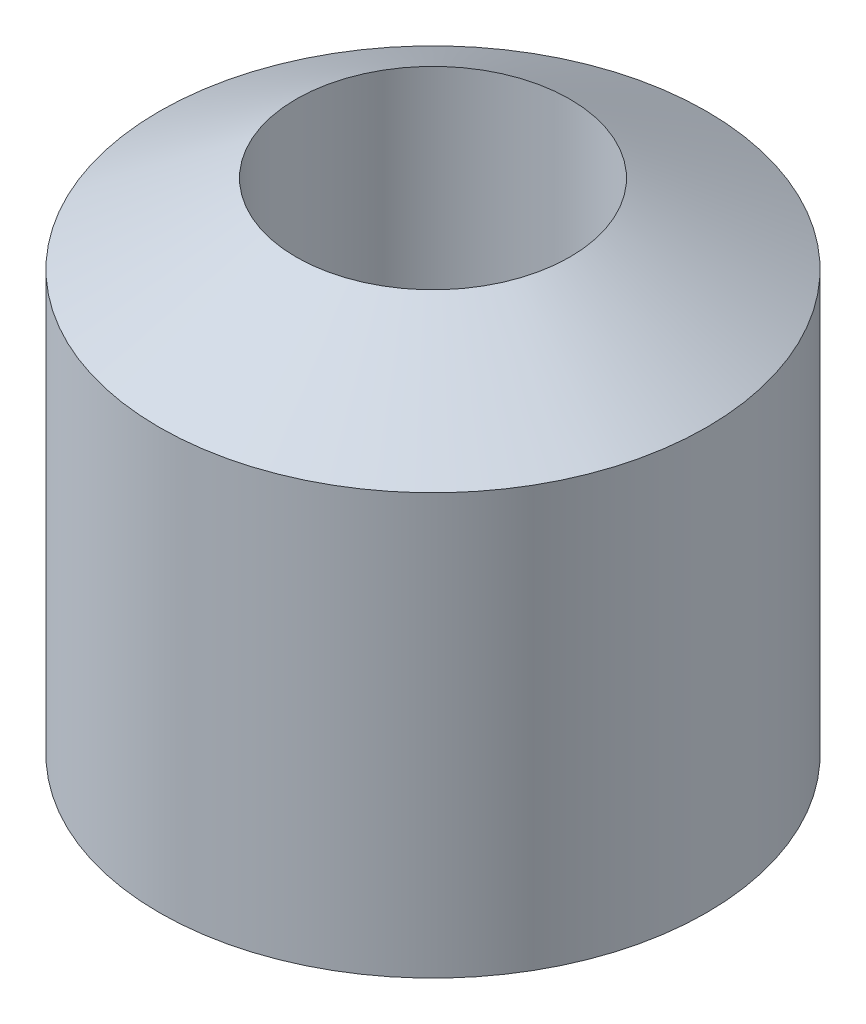
ISO-10303-21;
HEADER;
FILE_DESCRIPTION(('STEP AP214'),'2;1');
FILE_NAME('part.step','',(''),(''),'','','');
FILE_SCHEMA(('AUTOMOTIVE_DESIGN { 1 0 10303 214 1 1 1 1 }'));
ENDSEC;
DATA;
#1=APPLICATION_CONTEXT('core data for automotive mechanical design processes');
#2=APPLICATION_PROTOCOL_DEFINITION('international standard','automotive_design',2000,#1);
#3=PRODUCT_CONTEXT('',#1,'mechanical');
#4=PRODUCT('Part','Part','',(#3));
#5=PRODUCT_RELATED_PRODUCT_CATEGORY('part','',(#4));
#6=PRODUCT_DEFINITION_FORMATION('','',#4);
#7=PRODUCT_DEFINITION_CONTEXT('part definition',#1,'design');
#8=PRODUCT_DEFINITION('design','',#6,#7);
#9=PRODUCT_DEFINITION_SHAPE('','',#8);
#10=(LENGTH_UNIT() NAMED_UNIT(*) SI_UNIT(.MILLI.,.METRE.));
#11=(NAMED_UNIT(*) PLANE_ANGLE_UNIT() SI_UNIT($,.RADIAN.));
#12=(NAMED_UNIT(*) SI_UNIT($,.STERADIAN.) SOLID_ANGLE_UNIT());
#13=UNCERTAINTY_MEASURE_WITH_UNIT(LENGTH_MEASURE(1.E-05),#10,'distance_accuracy_value','');
#14=(GEOMETRIC_REPRESENTATION_CONTEXT(3) GLOBAL_UNCERTAINTY_ASSIGNED_CONTEXT((#13)) GLOBAL_UNIT_ASSIGNED_CONTEXT((#10,
#11,#12)) REPRESENTATION_CONTEXT('',''));
#15=CARTESIAN_POINT('',(0.,0.,0.));
#16=DIRECTION('',(0.,0.,1.));
#17=DIRECTION('',(1.,0.,0.));
#18=AXIS2_PLACEMENT_3D('',#15,#16,#17);
#19=CARTESIAN_POINT('',(0.,21.5,0.));
#20=DIRECTION('',(0.,-1.,0.));
#21=DIRECTION('',(0.,0.,-1.));
#22=AXIS2_PLACEMENT_3D('',#19,#20,#21);
#23=CONICAL_SURFACE('',#22,28.,1.04719755119659);
#24=CARTESIAN_POINT('',(0.,29.5829037686549,0.));
#25=DIRECTION('',(0.,1.,0.));
#26=DIRECTION('',(0.,0.,1.));
#27=AXIS2_PLACEMENT_3D('',#24,#25,#26);
#28=CIRCLE('',#27,14.);
#29=CARTESIAN_POINT('',(0.,29.5829037686549,14.));
#30=VERTEX_POINT('',#29);
#31=EDGE_CURVE('E10',#30,#30,#28,.T.);
#32=ORIENTED_EDGE('',*,*,#31,.F.);
#33=EDGE_LOOP('',(#32));
#34=FACE_BOUND('',#33,.T.);
#35=CARTESIAN_POINT('',(0.,21.5,0.));
#36=DIRECTION('',(0.,1.,0.));
#37=DIRECTION('',(0.,0.,1.));
#38=AXIS2_PLACEMENT_3D('',#35,#36,#37);
#39=CIRCLE('',#38,28.);
#40=CARTESIAN_POINT('',(0.,21.5,28.));
#41=VERTEX_POINT('',#40);
#42=EDGE_CURVE('E55',#41,#41,#39,.T.);
#43=ORIENTED_EDGE('',*,*,#42,.T.);
#44=EDGE_LOOP('',(#43));
#45=FACE_BOUND('',#44,.T.);
#46=ADVANCED_FACE('F41',(#34,#45),#23,.T.);
#47=CARTESIAN_POINT('',(0.,91.2500000000001,0.));
#48=DIRECTION('',(0.,1.,0.));
#49=DIRECTION('',(0.,0.,1.));
#50=AXIS2_PLACEMENT_3D('',#47,#48,#49);
#51=CYLINDRICAL_SURFACE('',#50,14.);
#52=CARTESIAN_POINT('',(0.,-29.5829037686549,0.));
#53=DIRECTION('',(0.,1.,0.));
#54=DIRECTION('',(0.,0.,1.));
#55=AXIS2_PLACEMENT_3D('',#52,#53,#54);
#56=CIRCLE('',#55,14.);
#57=CARTESIAN_POINT('',(0.,-29.5829037686549,14.));
#58=VERTEX_POINT('',#57);
#59=EDGE_CURVE('E47',#58,#58,#56,.T.);
#60=ORIENTED_EDGE('',*,*,#59,.F.);
#61=EDGE_LOOP('',(#60));
#62=FACE_BOUND('',#61,.T.);
#63=ORIENTED_EDGE('',*,*,#31,.T.);
#64=EDGE_LOOP('',(#63));
#65=FACE_BOUND('',#64,.T.);
#66=ADVANCED_FACE('F70',(#62,#65),#51,.F.);
#67=CARTESIAN_POINT('',(0.,-29.5829037686549,0.));
#68=DIRECTION('',(0.,1.,0.));
#69=DIRECTION('',(0.,0.,1.));
#70=AXIS2_PLACEMENT_3D('',#67,#68,#69);
#71=CONICAL_SURFACE('',#70,14.,1.04719755119659);
#72=CARTESIAN_POINT('',(0.,-21.5,0.));
#73=DIRECTION('',(0.,1.,0.));
#74=DIRECTION('',(0.,0.,1.));
#75=AXIS2_PLACEMENT_3D('',#72,#73,#74);
#76=CIRCLE('',#75,28.);
#77=CARTESIAN_POINT('',(0.,-21.5,28.));
#78=VERTEX_POINT('',#77);
#79=EDGE_CURVE('E51',#78,#78,#76,.T.);
#80=ORIENTED_EDGE('',*,*,#79,.F.);
#81=EDGE_LOOP('',(#80));
#82=FACE_BOUND('',#81,.T.);
#83=ORIENTED_EDGE('',*,*,#59,.T.);
#84=EDGE_LOOP('',(#83));
#85=FACE_BOUND('',#84,.T.);
#86=ADVANCED_FACE('F65',(#82,#85),#71,.T.);
#87=CARTESIAN_POINT('',(0.,91.2500000000001,0.));
#88=DIRECTION('',(0.,1.,0.));
#89=DIRECTION('',(0.,0.,1.));
#90=AXIS2_PLACEMENT_3D('',#87,#88,#89);
#91=CYLINDRICAL_SURFACE('',#90,28.);
#92=ORIENTED_EDGE('',*,*,#42,.F.);
#93=EDGE_LOOP('',(#92));
#94=FACE_BOUND('',#93,.T.);
#95=ORIENTED_EDGE('',*,*,#79,.T.);
#96=EDGE_LOOP('',(#95));
#97=FACE_BOUND('',#96,.T.);
#98=ADVANCED_FACE('F62',(#94,#97),#91,.T.);
#99=CLOSED_SHELL('',(#46,#66,#86,#98));
#100=MANIFOLD_SOLID_BREP('B2',#99);
#101=ADVANCED_BREP_SHAPE_REPRESENTATION('',(#18,#100),#14);
#102=SHAPE_DEFINITION_REPRESENTATION(#9,#101);
ENDSEC;
END-ISO-10303-21;
